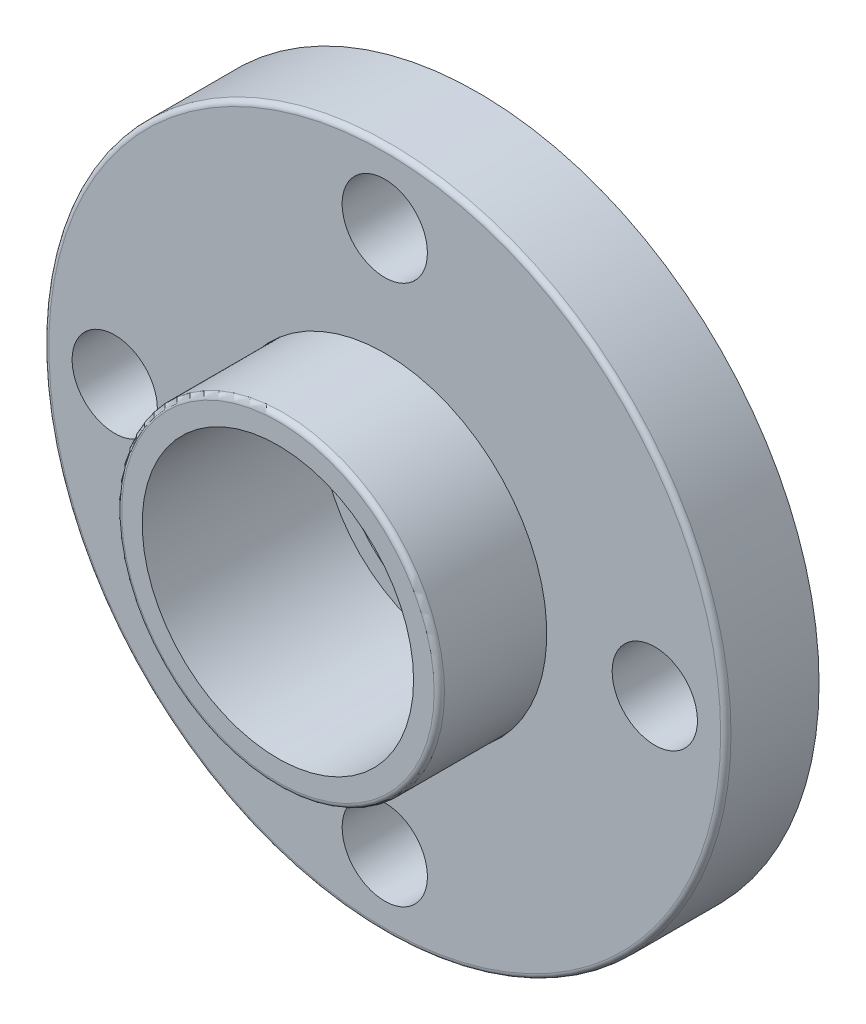
ISO-10303-21;
HEADER;
FILE_DESCRIPTION(('STEP AP214'),'2;1');
FILE_NAME('part.step','',(''),(''),'','','');
FILE_SCHEMA(('AUTOMOTIVE_DESIGN { 1 0 10303 214 1 1 1 1 }'));
ENDSEC;
DATA;
#1=APPLICATION_CONTEXT('core data for automotive mechanical design processes');
#2=APPLICATION_PROTOCOL_DEFINITION('international standard','automotive_design',2000,#1);
#3=PRODUCT_CONTEXT('',#1,'mechanical');
#4=PRODUCT('Part','Part','',(#3));
#5=PRODUCT_RELATED_PRODUCT_CATEGORY('part','',(#4));
#6=PRODUCT_DEFINITION_FORMATION('','',#4);
#7=PRODUCT_DEFINITION_CONTEXT('part definition',#1,'design');
#8=PRODUCT_DEFINITION('design','',#6,#7);
#9=PRODUCT_DEFINITION_SHAPE('','',#8);
#10=(LENGTH_UNIT() NAMED_UNIT(*) SI_UNIT(.MILLI.,.METRE.));
#11=(NAMED_UNIT(*) PLANE_ANGLE_UNIT() SI_UNIT($,.RADIAN.));
#12=(NAMED_UNIT(*) SI_UNIT($,.STERADIAN.) SOLID_ANGLE_UNIT());
#13=UNCERTAINTY_MEASURE_WITH_UNIT(LENGTH_MEASURE(1.E-05),#10,'distance_accuracy_value','');
#14=(GEOMETRIC_REPRESENTATION_CONTEXT(3) GLOBAL_UNCERTAINTY_ASSIGNED_CONTEXT((#13)) GLOBAL_UNIT_ASSIGNED_CONTEXT((#10,
#11,#12)) REPRESENTATION_CONTEXT('',''));
#15=CARTESIAN_POINT('',(0.,0.,0.));
#16=DIRECTION('',(0.,0.,1.));
#17=DIRECTION('',(1.,0.,0.));
#18=AXIS2_PLACEMENT_3D('',#15,#16,#17);
#19=CARTESIAN_POINT('',(0.,0.,0.));
#20=DIRECTION('',(0.,0.,-1.));
#21=DIRECTION('',(0.,1.,0.));
#22=AXIS2_PLACEMENT_3D('',#19,#20,#21);
#23=CYLINDRICAL_SURFACE('',#22,36.195);
#24=CARTESIAN_POINT('',(0.,0.,9.96372727272726));
#25=DIRECTION('',(0.,0.,-1.));
#26=DIRECTION('',(0.,1.,0.));
#27=AXIS2_PLACEMENT_3D('',#24,#25,#26);
#28=CIRCLE('',#27,36.195);
#29=CARTESIAN_POINT('',(0.,36.195,9.96372727272727));
#30=VERTEX_POINT('',#29);
#31=EDGE_CURVE('E63',#30,#30,#28,.T.);
#32=ORIENTED_EDGE('',*,*,#31,.T.);
#33=EDGE_LOOP('',(#32));
#34=FACE_BOUND('',#33,.T.);
#35=CARTESIAN_POINT('',(0.,0.,20.828));
#36=DIRECTION('',(0.,0.,-1.));
#37=DIRECTION('',(0.,1.,0.));
#38=AXIS2_PLACEMENT_3D('',#35,#36,#37);
#39=CIRCLE('',#38,36.195);
#40=CARTESIAN_POINT('',(0.,36.195,20.828));
#41=VERTEX_POINT('',#40);
#42=EDGE_CURVE('E58',#41,#41,#39,.T.);
#43=ORIENTED_EDGE('',*,*,#42,.F.);
#44=EDGE_LOOP('',(#43));
#45=FACE_BOUND('',#44,.T.);
#46=ADVANCED_FACE('F40',(#34,#45),#23,.F.);
#47=CARTESIAN_POINT('',(0.,36.068,9.96372727272727));
#48=DIRECTION('',(0.,0.,-1.));
#49=DIRECTION('',(0.,1.,0.));
#50=AXIS2_PLACEMENT_3D('',#47,#48,#49);
#51=PLANE('',#50);
#52=CARTESIAN_POINT('',(0.,0.,9.96372727272726));
#53=DIRECTION('',(0.,0.,-1.));
#54=DIRECTION('',(0.,1.,0.));
#55=AXIS2_PLACEMENT_3D('',#52,#53,#54);
#56=CIRCLE('',#55,44.577);
#57=CARTESIAN_POINT('',(0.,44.577,9.96372727272727));
#58=VERTEX_POINT('',#57);
#59=EDGE_CURVE('E65',#58,#58,#56,.T.);
#60=ORIENTED_EDGE('',*,*,#59,.T.);
#61=EDGE_LOOP('',(#60));
#62=FACE_BOUND('',#61,.T.);
#63=ORIENTED_EDGE('',*,*,#31,.F.);
#64=EDGE_LOOP('',(#63));
#65=FACE_BOUND('',#64,.T.);
#66=ADVANCED_FACE('F121',(#62,#65),#51,.T.);
#67=CARTESIAN_POINT('',(0.,0.,0.));
#68=DIRECTION('',(0.,0.,-1.));
#69=DIRECTION('',(0.,1.,0.));
#70=AXIS2_PLACEMENT_3D('',#67,#68,#69);
#71=CYLINDRICAL_SURFACE('',#70,44.577);
#72=CARTESIAN_POINT('',(0.,0.,0.));
#73=DIRECTION('',(0.,0.,-1.));
#74=DIRECTION('',(0.,1.,0.));
#75=AXIS2_PLACEMENT_3D('',#72,#73,#74);
#76=CIRCLE('',#75,44.577);
#77=CARTESIAN_POINT('',(0.,44.577,0.));
#78=VERTEX_POINT('',#77);
#79=EDGE_CURVE('E44',#78,#78,#76,.T.);
#80=ORIENTED_EDGE('',*,*,#79,.T.);
#81=EDGE_LOOP('',(#80));
#82=FACE_BOUND('',#81,.T.);
#83=ORIENTED_EDGE('',*,*,#59,.F.);
#84=EDGE_LOOP('',(#83));
#85=FACE_BOUND('',#84,.T.);
#86=ADVANCED_FACE('F107',(#82,#85),#71,.F.);
#87=CARTESIAN_POINT('',(0.,0.,19.6734545454545));
#88=DIRECTION('',(0.,0.,1.));
#89=DIRECTION('',(1.,0.,0.));
#90=AXIS2_PLACEMENT_3D('',#87,#88,#89);
#91=TOROIDAL_SURFACE('',#90,75.0454545454546,1.15454545454545);
#92=CARTESIAN_POINT('',(0.,0.,19.6734545454545));
#93=DIRECTION('',(0.,0.,1.));
#94=DIRECTION('',(1.,0.,0.));
#95=AXIS2_PLACEMENT_3D('',#92,#93,#94);
#96=CIRCLE('',#95,76.2);
#97=CARTESIAN_POINT('',(76.2,0.,19.6734545454545));
#98=VERTEX_POINT('',#97);
#99=EDGE_CURVE('E92',#98,#98,#96,.F.);
#100=ORIENTED_EDGE('',*,*,#99,.F.);
#101=EDGE_LOOP('',(#100));
#102=FACE_BOUND('',#101,.T.);
#103=CARTESIAN_POINT('',(0.,0.,20.828));
#104=DIRECTION('',(0.,0.,1.));
#105=DIRECTION('',(1.,0.,0.));
#106=AXIS2_PLACEMENT_3D('',#103,#104,#105);
#107=CIRCLE('',#106,75.0454545454546);
#108=CARTESIAN_POINT('',(75.0454545454546,0.,20.828));
#109=VERTEX_POINT('',#108);
#110=EDGE_CURVE('E62',#109,#109,#107,.T.);
#111=ORIENTED_EDGE('',*,*,#110,.F.);
#112=EDGE_LOOP('',(#111));
#113=FACE_BOUND('',#112,.T.);
#114=ADVANCED_FACE('F103',(#102,#113),#91,.T.);
#115=CARTESIAN_POINT('',(60.325,6.31870835297136E-13,0.));
#116=DIRECTION('',(0.,0.,1.));
#117=DIRECTION('',(1.,0.,0.));
#118=AXIS2_PLACEMENT_3D('',#115,#116,#117);
#119=CYLINDRICAL_SURFACE('',#118,9.525);
#120=CARTESIAN_POINT('',(60.325,6.31870835297136E-13,0.));
#121=DIRECTION('',(0.,0.,1.));
#122=DIRECTION('',(0.,-1.,0.));
#123=AXIS2_PLACEMENT_3D('',#120,#121,#122);
#124=CIRCLE('',#123,9.525);
#125=CARTESIAN_POINT('',(60.3250000000001,-9.52499999999937,0.));
#126=VERTEX_POINT('',#125);
#127=EDGE_CURVE('E11',#126,#126,#124,.T.);
#128=ORIENTED_EDGE('',*,*,#127,.F.);
#129=EDGE_LOOP('',(#128));
#130=FACE_BOUND('',#129,.T.);
#131=CARTESIAN_POINT('',(60.325,6.31870835297136E-13,20.828));
#132=DIRECTION('',(0.,0.,1.));
#133=DIRECTION('',(0.,-1.,0.));
#134=AXIS2_PLACEMENT_3D('',#131,#132,#133);
#135=CIRCLE('',#134,9.525);
#136=CARTESIAN_POINT('',(60.3250000000001,-9.52499999999937,20.828));
#137=VERTEX_POINT('',#136);
#138=EDGE_CURVE('E57',#137,#137,#135,.T.);
#139=ORIENTED_EDGE('',*,*,#138,.T.);
#140=EDGE_LOOP('',(#139));
#141=FACE_BOUND('',#140,.T.);
#142=ADVANCED_FACE('F106',(#130,#141),#119,.F.);
#143=CARTESIAN_POINT('',(4.21247223531424E-13,-60.325,0.));
#144=DIRECTION('',(0.,0.,1.));
#145=DIRECTION('',(1.,0.,0.));
#146=AXIS2_PLACEMENT_3D('',#143,#144,#145);
#147=CYLINDRICAL_SURFACE('',#146,9.525);
#148=CARTESIAN_POINT('',(4.21247223531424E-13,-60.325,0.));
#149=DIRECTION('',(0.,0.,1.));
#150=DIRECTION('',(-1.,0.,0.));
#151=AXIS2_PLACEMENT_3D('',#148,#149,#150);
#152=CIRCLE('',#151,9.525);
#153=CARTESIAN_POINT('',(-9.52499999999958,-60.3250000000001,0.));
#154=VERTEX_POINT('',#153);
#155=EDGE_CURVE('E48',#154,#154,#152,.T.);
#156=ORIENTED_EDGE('',*,*,#155,.F.);
#157=EDGE_LOOP('',(#156));
#158=FACE_BOUND('',#157,.T.);
#159=CARTESIAN_POINT('',(4.21247223531424E-13,-60.325,20.828));
#160=DIRECTION('',(0.,0.,1.));
#161=DIRECTION('',(-1.,0.,0.));
#162=AXIS2_PLACEMENT_3D('',#159,#160,#161);
#163=CIRCLE('',#162,9.525);
#164=CARTESIAN_POINT('',(-9.52499999999958,-60.3250000000001,20.828));
#165=VERTEX_POINT('',#164);
#166=EDGE_CURVE('E73',#165,#165,#163,.T.);
#167=ORIENTED_EDGE('',*,*,#166,.T.);
#168=EDGE_LOOP('',(#167));
#169=FACE_BOUND('',#168,.T.);
#170=ADVANCED_FACE('F146',(#158,#169),#147,.F.);
#171=CARTESIAN_POINT('',(-60.325,-2.10623611765712E-13,0.));
#172=DIRECTION('',(0.,0.,1.));
#173=DIRECTION('',(1.,0.,0.));
#174=AXIS2_PLACEMENT_3D('',#171,#172,#173);
#175=CYLINDRICAL_SURFACE('',#174,9.525);
#176=CARTESIAN_POINT('',(-60.325,-2.10623611765712E-13,0.));
#177=DIRECTION('',(0.,0.,1.));
#178=DIRECTION('',(0.,1.,0.));
#179=AXIS2_PLACEMENT_3D('',#176,#177,#178);
#180=CIRCLE('',#179,9.525);
#181=CARTESIAN_POINT('',(-60.325,9.52499999999979,0.));
#182=VERTEX_POINT('',#181);
#183=EDGE_CURVE('E53',#182,#182,#180,.T.);
#184=ORIENTED_EDGE('',*,*,#183,.F.);
#185=EDGE_LOOP('',(#184));
#186=FACE_BOUND('',#185,.T.);
#187=CARTESIAN_POINT('',(-60.325,-2.10623611765712E-13,20.828));
#188=DIRECTION('',(0.,0.,1.));
#189=DIRECTION('',(0.,1.,0.));
#190=AXIS2_PLACEMENT_3D('',#187,#188,#189);
#191=CIRCLE('',#190,9.525);
#192=CARTESIAN_POINT('',(-60.325,9.52499999999979,20.828));
#193=VERTEX_POINT('',#192);
#194=EDGE_CURVE('E77',#193,#193,#191,.T.);
#195=ORIENTED_EDGE('',*,*,#194,.T.);
#196=EDGE_LOOP('',(#195));
#197=FACE_BOUND('',#196,.T.);
#198=ADVANCED_FACE('F115',(#186,#197),#175,.F.);
#199=CARTESIAN_POINT('',(0.,0.,20.828));
#200=DIRECTION('',(0.,0.,1.));
#201=DIRECTION('',(1.,0.,0.));
#202=AXIS2_PLACEMENT_3D('',#199,#200,#201);
#203=PLANE('',#202);
#204=CARTESIAN_POINT('',(0.,60.325,20.828));
#205=DIRECTION('',(0.,0.,1.));
#206=DIRECTION('',(1.,0.,0.));
#207=AXIS2_PLACEMENT_3D('',#204,#205,#206);
#208=CIRCLE('',#207,9.525);
#209=CARTESIAN_POINT('',(9.525,60.325,20.828));
#210=VERTEX_POINT('',#209);
#211=EDGE_CURVE('E61',#210,#210,#208,.T.);
#212=ORIENTED_EDGE('',*,*,#211,.F.);
#213=EDGE_LOOP('',(#212));
#214=FACE_BOUND('',#213,.T.);
#215=ORIENTED_EDGE('',*,*,#194,.F.);
#216=EDGE_LOOP('',(#215));
#217=FACE_BOUND('',#216,.T.);
#218=ORIENTED_EDGE('',*,*,#166,.F.);
#219=EDGE_LOOP('',(#218));
#220=FACE_BOUND('',#219,.T.);
#221=ORIENTED_EDGE('',*,*,#138,.F.);
#222=EDGE_LOOP('',(#221));
#223=FACE_BOUND('',#222,.T.);
#224=ORIENTED_EDGE('',*,*,#110,.T.);
#225=EDGE_LOOP('',(#224));
#226=FACE_BOUND('',#225,.T.);
#227=ORIENTED_EDGE('',*,*,#42,.T.);
#228=EDGE_LOOP('',(#227));
#229=FACE_BOUND('',#228,.T.);
#230=ADVANCED_FACE('F111',(#214,#217,#220,#223,#226,#229),#203,.T.);
#231=CARTESIAN_POINT('',(0.,60.325,0.));
#232=DIRECTION('',(0.,0.,1.));
#233=DIRECTION('',(1.,0.,0.));
#234=AXIS2_PLACEMENT_3D('',#231,#232,#233);
#235=CYLINDRICAL_SURFACE('',#234,9.525);
#236=CARTESIAN_POINT('',(0.,60.325,0.));
#237=DIRECTION('',(0.,0.,1.));
#238=DIRECTION('',(1.,0.,0.));
#239=AXIS2_PLACEMENT_3D('',#236,#237,#238);
#240=CIRCLE('',#239,9.525);
#241=CARTESIAN_POINT('',(9.525,60.325,0.));
#242=VERTEX_POINT('',#241);
#243=EDGE_CURVE('E85',#242,#242,#240,.T.);
#244=ORIENTED_EDGE('',*,*,#243,.F.);
#245=EDGE_LOOP('',(#244));
#246=FACE_BOUND('',#245,.T.);
#247=ORIENTED_EDGE('',*,*,#211,.T.);
#248=EDGE_LOOP('',(#247));
#249=FACE_BOUND('',#248,.T.);
#250=ADVANCED_FACE('F114',(#246,#249),#235,.F.);
#251=CARTESIAN_POINT('',(0.,0.,20.828));
#252=DIRECTION('',(0.,0.,-1.));
#253=DIRECTION('',(-1.,0.,0.));
#254=AXIS2_PLACEMENT_3D('',#251,#252,#253);
#255=CYLINDRICAL_SURFACE('',#254,76.2);
#256=ORIENTED_EDGE('',*,*,#99,.T.);
#257=EDGE_LOOP('',(#256));
#258=FACE_BOUND('',#257,.T.);
#259=CARTESIAN_POINT('',(0.,0.,0.));
#260=DIRECTION('',(0.,0.,1.));
#261=DIRECTION('',(1.,0.,0.));
#262=AXIS2_PLACEMENT_3D('',#259,#260,#261);
#263=CIRCLE('',#262,76.2);
#264=CARTESIAN_POINT('',(76.2,0.,0.));
#265=VERTEX_POINT('',#264);
#266=EDGE_CURVE('E89',#265,#265,#263,.T.);
#267=ORIENTED_EDGE('',*,*,#266,.T.);
#268=EDGE_LOOP('',(#267));
#269=FACE_BOUND('',#268,.T.);
#270=ADVANCED_FACE('F100',(#258,#269),#255,.T.);
#271=CARTESIAN_POINT('',(0.,0.,0.));
#272=DIRECTION('',(0.,0.,1.));
#273=DIRECTION('',(1.,0.,0.));
#274=AXIS2_PLACEMENT_3D('',#271,#272,#273);
#275=PLANE('',#274);
#276=ORIENTED_EDGE('',*,*,#266,.F.);
#277=EDGE_LOOP('',(#276));
#278=FACE_BOUND('',#277,.T.);
#279=ORIENTED_EDGE('',*,*,#243,.T.);
#280=EDGE_LOOP('',(#279));
#281=FACE_BOUND('',#280,.T.);
#282=ORIENTED_EDGE('',*,*,#183,.T.);
#283=EDGE_LOOP('',(#282));
#284=FACE_BOUND('',#283,.T.);
#285=ORIENTED_EDGE('',*,*,#155,.T.);
#286=EDGE_LOOP('',(#285));
#287=FACE_BOUND('',#286,.T.);
#288=ORIENTED_EDGE('',*,*,#127,.T.);
#289=EDGE_LOOP('',(#288));
#290=FACE_BOUND('',#289,.T.);
#291=ORIENTED_EDGE('',*,*,#79,.F.);
#292=EDGE_LOOP('',(#291));
#293=FACE_BOUND('',#292,.T.);
#294=ADVANCED_FACE('F42',(#278,#281,#284,#287,#290,#293),#275,.F.);
#295=CLOSED_SHELL('',(#46,#66,#86,#114,#142,#170,#198,#230,#250,#270,#294));
#296=MANIFOLD_SOLID_BREP('B2',#295);
#297=CARTESIAN_POINT('',(0.,0.,0.));
#298=DIRECTION('',(0.,0.,1.));
#299=DIRECTION('',(1.,0.,0.));
#300=AXIS2_PLACEMENT_3D('',#297,#298,#299);
#301=PLANE('',#300);
#302=CARTESIAN_POINT('',(0.,0.,0.));
#303=DIRECTION('',(0.,0.,-1.));
#304=DIRECTION('',(0.,1.,0.));
#305=AXIS2_PLACEMENT_3D('',#302,#303,#304);
#306=CIRCLE('',#305,44.45);
#307=CARTESIAN_POINT('',(0.,44.45,0.));
#308=VERTEX_POINT('',#307);
#309=EDGE_CURVE('E279',#308,#308,#306,.T.);
#310=ORIENTED_EDGE('',*,*,#309,.T.);
#311=EDGE_LOOP('',(#310));
#312=FACE_BOUND('',#311,.T.);
#313=CARTESIAN_POINT('',(0.,0.,0.));
#314=DIRECTION('',(0.,0.,1.));
#315=DIRECTION('',(1.,0.,0.));
#316=AXIS2_PLACEMENT_3D('',#313,#314,#315);
#317=CIRCLE('',#316,26.162);
#318=CARTESIAN_POINT('',(26.162,0.,0.));
#319=VERTEX_POINT('',#318);
#320=EDGE_CURVE('E262',#319,#319,#317,.T.);
#321=ORIENTED_EDGE('',*,*,#320,.T.);
#322=EDGE_LOOP('',(#321));
#323=FACE_BOUND('',#322,.T.);
#324=ADVANCED_FACE('F247',(#312,#323),#301,.F.);
#325=CARTESIAN_POINT('',(0.,0.,44.704));
#326=DIRECTION('',(0.,0.,-1.));
#327=DIRECTION('',(-1.,0.,0.));
#328=AXIS2_PLACEMENT_3D('',#325,#326,#327);
#329=CYLINDRICAL_SURFACE('',#328,36.068);
#330=CARTESIAN_POINT('',(0.,0.,43.5494545454545));
#331=DIRECTION('',(0.,0.,1.));
#332=DIRECTION('',(1.,0.,0.));
#333=AXIS2_PLACEMENT_3D('',#330,#331,#332);
#334=CIRCLE('',#333,36.068);
#335=CARTESIAN_POINT('',(36.068,0.,43.5494545454545));
#336=VERTEX_POINT('',#335);
#337=EDGE_CURVE('E39',#336,#336,#334,.F.);
#338=ORIENTED_EDGE('',*,*,#337,.T.);
#339=EDGE_LOOP('',(#338));
#340=FACE_BOUND('',#339,.T.);
#341=CARTESIAN_POINT('',(0.,0.,9.83672727272726));
#342=DIRECTION('',(0.,0.,-1.));
#343=DIRECTION('',(0.,1.,0.));
#344=AXIS2_PLACEMENT_3D('',#341,#342,#343);
#345=CIRCLE('',#344,36.068);
#346=CARTESIAN_POINT('',(0.,36.068,9.83672727272727));
#347=VERTEX_POINT('',#346);
#348=EDGE_CURVE('E276',#347,#347,#345,.T.);
#349=ORIENTED_EDGE('',*,*,#348,.F.);
#350=EDGE_LOOP('',(#349));
#351=FACE_BOUND('',#350,.T.);
#352=ADVANCED_FACE('F298',(#340,#351),#329,.T.);
#353=CARTESIAN_POINT('',(0.,0.,44.704));
#354=DIRECTION('',(0.,0.,1.));
#355=DIRECTION('',(1.,0.,0.));
#356=AXIS2_PLACEMENT_3D('',#353,#354,#355);
#357=PLANE('',#356);
#358=CARTESIAN_POINT('',(0.,0.,44.704));
#359=DIRECTION('',(0.,0.,1.));
#360=DIRECTION('',(1.,0.,0.));
#361=AXIS2_PLACEMENT_3D('',#358,#359,#360);
#362=CIRCLE('',#361,30.3149);
#363=CARTESIAN_POINT('',(30.3149,0.,44.704));
#364=VERTEX_POINT('',#363);
#365=EDGE_CURVE('E267',#364,#364,#362,.T.);
#366=ORIENTED_EDGE('',*,*,#365,.F.);
#367=EDGE_LOOP('',(#366));
#368=FACE_BOUND('',#367,.T.);
#369=CARTESIAN_POINT('',(0.,0.,44.704));
#370=DIRECTION('',(0.,0.,1.));
#371=DIRECTION('',(1.,0.,0.));
#372=AXIS2_PLACEMENT_3D('',#369,#370,#371);
#373=CIRCLE('',#372,34.9134545454545);
#374=CARTESIAN_POINT('',(34.9134545454545,0.,44.704));
#375=VERTEX_POINT('',#374);
#376=EDGE_CURVE('E254',#375,#375,#373,.T.);
#377=ORIENTED_EDGE('',*,*,#376,.T.);
#378=EDGE_LOOP('',(#377));
#379=FACE_BOUND('',#378,.T.);
#380=ADVANCED_FACE('F300',(#368,#379),#357,.T.);
#381=CARTESIAN_POINT('',(0.,0.,43.5494545454545));
#382=DIRECTION('',(0.,0.,1.));
#383=DIRECTION('',(1.,0.,0.));
#384=AXIS2_PLACEMENT_3D('',#381,#382,#383);
#385=TOROIDAL_SURFACE('',#384,34.9134545454545,1.15454545454545);
#386=ORIENTED_EDGE('',*,*,#337,.F.);
#387=EDGE_LOOP('',(#386));
#388=FACE_BOUND('',#387,.T.);
#389=ORIENTED_EDGE('',*,*,#376,.F.);
#390=EDGE_LOOP('',(#389));
#391=FACE_BOUND('',#390,.T.);
#392=ADVANCED_FACE('F249',(#388,#391),#385,.T.);
#393=CARTESIAN_POINT('',(0.,26.162,5.08));
#394=DIRECTION('',(0.,0.,-1.));
#395=DIRECTION('',(-1.,0.,0.));
#396=AXIS2_PLACEMENT_3D('',#393,#394,#395);
#397=PLANE('',#396);
#398=CARTESIAN_POINT('',(0.,0.,5.08));
#399=DIRECTION('',(0.,0.,1.));
#400=DIRECTION('',(1.,0.,0.));
#401=AXIS2_PLACEMENT_3D('',#398,#399,#400);
#402=CIRCLE('',#401,26.162);
#403=CARTESIAN_POINT('',(26.162,0.,5.08));
#404=VERTEX_POINT('',#403);
#405=EDGE_CURVE('E258',#404,#404,#402,.T.);
#406=ORIENTED_EDGE('',*,*,#405,.F.);
#407=EDGE_LOOP('',(#406));
#408=FACE_BOUND('',#407,.T.);
#409=CARTESIAN_POINT('',(0.,0.,5.08));
#410=DIRECTION('',(0.,0.,1.));
#411=DIRECTION('',(1.,0.,0.));
#412=AXIS2_PLACEMENT_3D('',#409,#410,#411);
#413=CIRCLE('',#412,30.0863);
#414=CARTESIAN_POINT('',(30.0863,0.,5.08));
#415=VERTEX_POINT('',#414);
#416=EDGE_CURVE('E270',#415,#415,#413,.T.);
#417=ORIENTED_EDGE('',*,*,#416,.T.);
#418=EDGE_LOOP('',(#417));
#419=FACE_BOUND('',#418,.T.);
#420=ADVANCED_FACE('F309',(#408,#419),#397,.F.);
#421=CARTESIAN_POINT('',(0.,0.,44.704));
#422=DIRECTION('',(0.,0.,1.));
#423=DIRECTION('',(1.,0.,0.));
#424=AXIS2_PLACEMENT_3D('',#421,#422,#423);
#425=CYLINDRICAL_SURFACE('',#424,26.162);
#426=ORIENTED_EDGE('',*,*,#320,.F.);
#427=EDGE_LOOP('',(#426));
#428=FACE_BOUND('',#427,.T.);
#429=ORIENTED_EDGE('',*,*,#405,.T.);
#430=EDGE_LOOP('',(#429));
#431=FACE_BOUND('',#430,.T.);
#432=ADVANCED_FACE('F312',(#428,#431),#425,.F.);
#433=CARTESIAN_POINT('',(0.,0.,44.704));
#434=DIRECTION('',(0.,0.,1.));
#435=DIRECTION('',(1.,0.,0.));
#436=AXIS2_PLACEMENT_3D('',#433,#434,#435);
#437=CONICAL_SURFACE('',#436,30.3149,0.00576916676277115);
#438=ORIENTED_EDGE('',*,*,#416,.F.);
#439=EDGE_LOOP('',(#438));
#440=FACE_BOUND('',#439,.T.);
#441=ORIENTED_EDGE('',*,*,#365,.T.);
#442=EDGE_LOOP('',(#441));
#443=FACE_BOUND('',#442,.T.);
#444=ADVANCED_FACE('F289',(#440,#443),#437,.F.);
#445=CARTESIAN_POINT('',(0.,0.,0.));
#446=DIRECTION('',(0.,0.,-1.));
#447=DIRECTION('',(0.,1.,0.));
#448=AXIS2_PLACEMENT_3D('',#445,#446,#447);
#449=CYLINDRICAL_SURFACE('',#448,44.45);
#450=ORIENTED_EDGE('',*,*,#309,.F.);
#451=EDGE_LOOP('',(#450));
#452=FACE_BOUND('',#451,.T.);
#453=CARTESIAN_POINT('',(0.,0.,9.83672727272726));
#454=DIRECTION('',(0.,0.,-1.));
#455=DIRECTION('',(0.,1.,0.));
#456=AXIS2_PLACEMENT_3D('',#453,#454,#455);
#457=CIRCLE('',#456,44.45);
#458=CARTESIAN_POINT('',(0.,44.45,9.83672727272727));
#459=VERTEX_POINT('',#458);
#460=EDGE_CURVE('E273',#459,#459,#457,.T.);
#461=ORIENTED_EDGE('',*,*,#460,.T.);
#462=EDGE_LOOP('',(#461));
#463=FACE_BOUND('',#462,.T.);
#464=ADVANCED_FACE('F285',(#452,#463),#449,.T.);
#465=CARTESIAN_POINT('',(0.,36.068,9.83672727272727));
#466=DIRECTION('',(0.,0.,-1.));
#467=DIRECTION('',(0.,1.,0.));
#468=AXIS2_PLACEMENT_3D('',#465,#466,#467);
#469=PLANE('',#468);
#470=ORIENTED_EDGE('',*,*,#460,.F.);
#471=EDGE_LOOP('',(#470));
#472=FACE_BOUND('',#471,.T.);
#473=ORIENTED_EDGE('',*,*,#348,.T.);
#474=EDGE_LOOP('',(#473));
#475=FACE_BOUND('',#474,.T.);
#476=ADVANCED_FACE('F288',(#472,#475),#469,.F.);
#477=CLOSED_SHELL('',(#324,#352,#380,#392,#420,#432,#444,#464,#476));
#478=MANIFOLD_SOLID_BREP('B6',#477);
#479=ADVANCED_BREP_SHAPE_REPRESENTATION('',(#18,#296,#478),#14);
#480=SHAPE_DEFINITION_REPRESENTATION(#9,#479);
ENDSEC;
END-ISO-10303-21;
